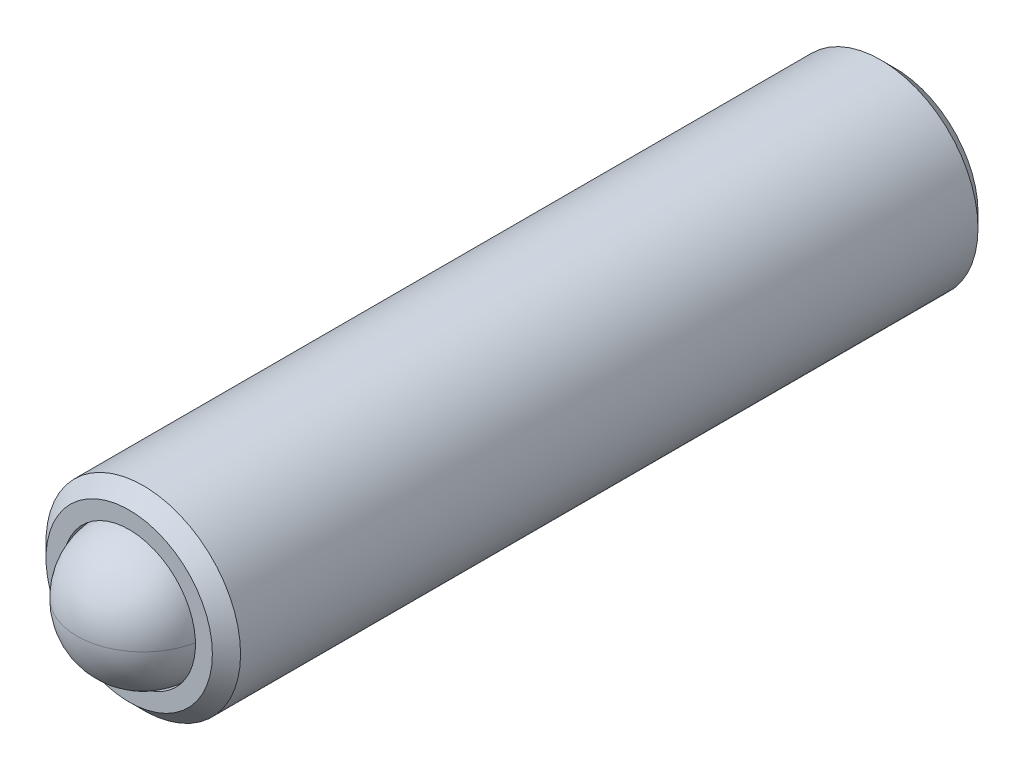
ISO-10303-21;
HEADER;
FILE_DESCRIPTION(('STEP AP214'),'2;1');
FILE_NAME('part.step','',(''),(''),'','','');
FILE_SCHEMA(('AUTOMOTIVE_DESIGN { 1 0 10303 214 1 1 1 1 }'));
ENDSEC;
DATA;
#1=APPLICATION_CONTEXT('core data for automotive mechanical design processes');
#2=APPLICATION_PROTOCOL_DEFINITION('international standard','automotive_design',2000,#1);
#3=PRODUCT_CONTEXT('',#1,'mechanical');
#4=PRODUCT('Part','Part','',(#3));
#5=PRODUCT_RELATED_PRODUCT_CATEGORY('part','',(#4));
#6=PRODUCT_DEFINITION_FORMATION('','',#4);
#7=PRODUCT_DEFINITION_CONTEXT('part definition',#1,'design');
#8=PRODUCT_DEFINITION('design','',#6,#7);
#9=PRODUCT_DEFINITION_SHAPE('','',#8);
#10=(LENGTH_UNIT() NAMED_UNIT(*) SI_UNIT(.MILLI.,.METRE.));
#11=(NAMED_UNIT(*) PLANE_ANGLE_UNIT() SI_UNIT($,.RADIAN.));
#12=(NAMED_UNIT(*) SI_UNIT($,.STERADIAN.) SOLID_ANGLE_UNIT());
#13=UNCERTAINTY_MEASURE_WITH_UNIT(LENGTH_MEASURE(1.E-05),#10,'distance_accuracy_value','');
#14=(GEOMETRIC_REPRESENTATION_CONTEXT(3) GLOBAL_UNCERTAINTY_ASSIGNED_CONTEXT((#13)) GLOBAL_UNIT_ASSIGNED_CONTEXT((#10,
#11,#12)) REPRESENTATION_CONTEXT('',''));
#15=CARTESIAN_POINT('',(0.,0.,0.));
#16=DIRECTION('',(0.,0.,1.));
#17=DIRECTION('',(1.,0.,0.));
#18=AXIS2_PLACEMENT_3D('',#15,#16,#17);
#19=CARTESIAN_POINT('',(0.,0.,6.645275));
#20=DIRECTION('',(0.,1.,0.));
#21=DIRECTION('',(1.,0.,0.));
#22=AXIS2_PLACEMENT_3D('',#19,#20,#21);
#23=SPHERICAL_SURFACE('',#22,1.190625);
#24=CARTESIAN_POINT('',(0.,0.,6.645275));
#25=DIRECTION('',(0.,0.,1.));
#26=DIRECTION('',(1.,0.,0.));
#27=AXIS2_PLACEMENT_3D('',#24,#25,#26);
#28=CIRCLE('',#27,1.190625);
#29=CARTESIAN_POINT('',(1.190625,0.,6.645275));
#30=VERTEX_POINT('',#29);
#31=CARTESIAN_POINT('',(-1.190625,0.,6.645275));
#32=VERTEX_POINT('',#31);
#33=EDGE_CURVE('P0_E33',#30,#32,#28,.T.);
#34=ORIENTED_EDGE('',*,*,#33,.T.);
#35=CARTESIAN_POINT('',(0.,0.,6.645275));
#36=DIRECTION('',(0.,1.,0.));
#37=DIRECTION('',(0.,0.,1.));
#38=AXIS2_PLACEMENT_3D('',#35,#36,#37);
#39=CIRCLE('',#38,1.190625);
#40=EDGE_CURVE('P0_E10',#32,#30,#39,.T.);
#41=ORIENTED_EDGE('',*,*,#40,.T.);
#42=EDGE_LOOP('',(#34,#41));
#43=FACE_BOUND('',#42,.T.);
#44=ADVANCED_FACE('P0_F16',(#43),#23,.T.);
#45=ORIENTED_EDGE('',*,*,#33,.F.);
#46=CARTESIAN_POINT('',(0.,0.,6.645275));
#47=DIRECTION('',(0.,1.,0.));
#48=DIRECTION('',(0.,0.,1.));
#49=AXIS2_PLACEMENT_3D('',#46,#47,#48);
#50=CIRCLE('',#49,1.190625);
#51=EDGE_CURVE('P0_E23',#30,#32,#50,.T.);
#52=ORIENTED_EDGE('',*,*,#51,.T.);
#53=EDGE_LOOP('',(#45,#52));
#54=FACE_BOUND('',#53,.T.);
#55=ADVANCED_FACE('P0_F40',(#54),#23,.T.);
#56=ORIENTED_EDGE('',*,*,#40,.F.);
#57=EDGE_CURVE('P0_E36',#32,#30,#28,.T.);
#58=ORIENTED_EDGE('',*,*,#57,.T.);
#59=EDGE_LOOP('',(#56,#58));
#60=FACE_BOUND('',#59,.T.);
#61=ADVANCED_FACE('P0_F38',(#60),#23,.T.);
#62=ORIENTED_EDGE('',*,*,#51,.F.);
#63=ORIENTED_EDGE('',*,*,#57,.F.);
#64=EDGE_LOOP('',(#62,#63));
#65=FACE_BOUND('',#64,.T.);
#66=ADVANCED_FACE('P0_F18',(#65),#23,.T.);
#67=CLOSED_SHELL('',(#44,#55,#61,#66));
#68=MANIFOLD_SOLID_BREP('P0_B1',#67);
#69=CARTESIAN_POINT('',(0.,0.,6.6421));
#70=DIRECTION('',(0.,0.,-1.));
#71=DIRECTION('',(-1.,0.,0.));
#72=AXIS2_PLACEMENT_3D('',#69,#70,#71);
#73=CONICAL_SURFACE('',#72,1.7526,0.785398163397448);
#74=CARTESIAN_POINT('',(0.,0.,6.8961));
#75=DIRECTION('',(0.,0.,1.));
#76=DIRECTION('',(1.,0.,0.));
#77=AXIS2_PLACEMENT_3D('',#74,#75,#76);
#78=CIRCLE('',#77,1.4986);
#79=CARTESIAN_POINT('',(1.4986,0.,6.8961));
#80=VERTEX_POINT('',#79);
#81=EDGE_CURVE('P1_E187',#80,#80,#78,.T.);
#82=ORIENTED_EDGE('',*,*,#81,.F.);
#83=EDGE_LOOP('',(#82));
#84=FACE_BOUND('',#83,.T.);
#85=CARTESIAN_POINT('',(0.,0.,6.6421));
#86=DIRECTION('',(0.,0.,1.));
#87=DIRECTION('',(1.,0.,0.));
#88=AXIS2_PLACEMENT_3D('',#85,#86,#87);
#89=CIRCLE('',#88,1.7526);
#90=CARTESIAN_POINT('',(1.7526,0.,6.6421));
#91=VERTEX_POINT('',#90);
#92=EDGE_CURVE('P1_E29',#91,#91,#89,.T.);
#93=ORIENTED_EDGE('',*,*,#92,.T.);
#94=EDGE_LOOP('',(#93));
#95=FACE_BOUND('',#94,.T.);
#96=ADVANCED_FACE('P1_F17',(#84,#95),#73,.T.);
#97=CARTESIAN_POINT('',(0.,0.,6.8961));
#98=DIRECTION('',(0.,0.,1.));
#99=DIRECTION('',(1.,0.,0.));
#100=AXIS2_PLACEMENT_3D('',#97,#98,#99);
#101=CYLINDRICAL_SURFACE('',#100,1.7526);
#102=ORIENTED_EDGE('',*,*,#92,.F.);
#103=EDGE_LOOP('',(#102));
#104=FACE_BOUND('',#103,.T.);
#105=CARTESIAN_POINT('',(0.,0.,-6.6421));
#106=DIRECTION('',(0.,0.,1.));
#107=DIRECTION('',(1.,0.,0.));
#108=AXIS2_PLACEMENT_3D('',#105,#106,#107);
#109=CIRCLE('',#108,1.7526);
#110=CARTESIAN_POINT('',(1.7526,0.,-6.6421));
#111=VERTEX_POINT('',#110);
#112=EDGE_CURVE('P1_E190',#111,#111,#109,.T.);
#113=ORIENTED_EDGE('',*,*,#112,.T.);
#114=EDGE_LOOP('',(#113));
#115=FACE_BOUND('',#114,.T.);
#116=ADVANCED_FACE('P1_F177',(#104,#115),#101,.T.);
#117=CARTESIAN_POINT('',(0.,0.,-6.8961));
#118=DIRECTION('',(0.,0.,1.));
#119=DIRECTION('',(1.,0.,0.));
#120=AXIS2_PLACEMENT_3D('',#117,#118,#119);
#121=CONICAL_SURFACE('',#120,1.4986,0.78539816339745);
#122=ORIENTED_EDGE('',*,*,#112,.F.);
#123=EDGE_LOOP('',(#122));
#124=FACE_BOUND('',#123,.T.);
#125=CARTESIAN_POINT('',(0.,0.,-6.8961));
#126=DIRECTION('',(0.,0.,1.));
#127=DIRECTION('',(1.,0.,0.));
#128=AXIS2_PLACEMENT_3D('',#125,#126,#127);
#129=CIRCLE('',#128,1.4986);
#130=CARTESIAN_POINT('',(1.4986,0.,-6.8961));
#131=VERTEX_POINT('',#130);
#132=EDGE_CURVE('P1_E192',#131,#131,#129,.T.);
#133=ORIENTED_EDGE('',*,*,#132,.T.);
#134=EDGE_LOOP('',(#133));
#135=FACE_BOUND('',#134,.T.);
#136=ADVANCED_FACE('P1_F182',(#124,#135),#121,.T.);
#137=CARTESIAN_POINT('',(0.,1.4986,-6.8961));
#138=DIRECTION('',(0.,0.,1.));
#139=DIRECTION('',(1.,0.,0.));
#140=AXIS2_PLACEMENT_3D('',#137,#138,#139);
#141=PLANE('',#140);
#142=CARTESIAN_POINT('',(0.,0.,-6.8961));
#143=DIRECTION('',(0.,0.,-1.));
#144=DIRECTION('',(0.,1.,0.));
#145=AXIS2_PLACEMENT_3D('',#142,#143,#144);
#146=CIRCLE('',#145,1.14567944042316);
#147=CARTESIAN_POINT('',(1.14567944042316,0.,-6.8961));
#148=VERTEX_POINT('',#147);
#149=CARTESIAN_POINT('',(0.57283972021158,-0.992187500000002,-6.8961));
#150=VERTEX_POINT('',#149);
#151=EDGE_CURVE('P1_E42',#148,#150,#146,.T.);
#152=ORIENTED_EDGE('',*,*,#151,.F.);
#153=CARTESIAN_POINT('',(0.572839720211582,0.9921875,-6.8961));
#154=VERTEX_POINT('',#153);
#155=EDGE_CURVE('P1_E115',#154,#148,#146,.T.);
#156=ORIENTED_EDGE('',*,*,#155,.F.);
#157=CARTESIAN_POINT('',(-0.572839720211581,0.9921875,-6.8961));
#158=VERTEX_POINT('',#157);
#159=EDGE_CURVE('P1_E114',#158,#154,#146,.T.);
#160=ORIENTED_EDGE('',*,*,#159,.F.);
#161=CARTESIAN_POINT('',(-1.14567944042316,0.,-6.8961));
#162=VERTEX_POINT('',#161);
#163=EDGE_CURVE('P1_E85',#162,#158,#146,.T.);
#164=ORIENTED_EDGE('',*,*,#163,.F.);
#165=CARTESIAN_POINT('',(-0.572839720211584,-0.9921875,-6.8961));
#166=VERTEX_POINT('',#165);
#167=EDGE_CURVE('P1_E77',#166,#162,#146,.T.);
#168=ORIENTED_EDGE('',*,*,#167,.F.);
#169=EDGE_CURVE('P1_E35',#150,#166,#146,.T.);
#170=ORIENTED_EDGE('',*,*,#169,.F.);
#171=EDGE_LOOP('',(#152,#156,#160,#164,#168,#170));
#172=FACE_BOUND('',#171,.T.);
#173=ORIENTED_EDGE('',*,*,#132,.F.);
#174=EDGE_LOOP('',(#173));
#175=FACE_BOUND('',#174,.T.);
#176=ADVANCED_FACE('P1_F111',(#172,#175),#141,.F.);
#177=CARTESIAN_POINT('',(0.,1.4986,6.8961));
#178=DIRECTION('',(0.,0.,-1.));
#179=DIRECTION('',(-1.,0.,0.));
#180=AXIS2_PLACEMENT_3D('',#177,#178,#179);
#181=PLANE('',#180);
#182=CARTESIAN_POINT('',(0.,0.,6.8961));
#183=DIRECTION('',(0.,0.,-1.));
#184=DIRECTION('',(-1.,0.,0.));
#185=AXIS2_PLACEMENT_3D('',#182,#183,#184);
#186=CIRCLE('',#185,1.1938);
#187=CARTESIAN_POINT('',(-1.1938,0.,6.8961));
#188=VERTEX_POINT('',#187);
#189=EDGE_CURVE('P1_E198',#188,#188,#186,.T.);
#190=ORIENTED_EDGE('',*,*,#189,.T.);
#191=EDGE_LOOP('',(#190));
#192=FACE_BOUND('',#191,.T.);
#193=ORIENTED_EDGE('',*,*,#81,.T.);
#194=EDGE_LOOP('',(#193));
#195=FACE_BOUND('',#194,.T.);
#196=ADVANCED_FACE('P1_F252',(#192,#195),#181,.F.);
#197=CARTESIAN_POINT('',(0.,0.,4.96147697729954));
#198=DIRECTION('',(0.,0.,-1.));
#199=DIRECTION('',(-1.,0.,0.));
#200=AXIS2_PLACEMENT_3D('',#197,#198,#199);
#201=CYLINDRICAL_SURFACE('',#200,1.1938);
#202=ORIENTED_EDGE('',*,*,#189,.F.);
#203=EDGE_LOOP('',(#202));
#204=FACE_BOUND('',#203,.T.);
#205=CARTESIAN_POINT('',(0.,0.,6.15527697729953));
#206=DIRECTION('',(0.,0.,-1.));
#207=DIRECTION('',(-1.,0.,0.));
#208=AXIS2_PLACEMENT_3D('',#205,#206,#207);
#209=CIRCLE('',#208,1.1938);
#210=CARTESIAN_POINT('',(-1.1938,0.,6.15527697729953));
#211=VERTEX_POINT('',#210);
#212=EDGE_CURVE('P1_E201',#211,#211,#209,.T.);
#213=ORIENTED_EDGE('',*,*,#212,.T.);
#214=EDGE_LOOP('',(#213));
#215=FACE_BOUND('',#214,.T.);
#216=ADVANCED_FACE('P1_F246',(#204,#215),#201,.F.);
#217=CARTESIAN_POINT('',(0.,0.,4.96147697729954));
#218=DIRECTION('',(0.,0.,1.));
#219=DIRECTION('',(1.,0.,0.));
#220=AXIS2_PLACEMENT_3D('',#217,#218,#219);
#221=CONICAL_SURFACE('',#220,0.,0.78539816339745);
#222=ORIENTED_EDGE('',*,*,#212,.F.);
#223=EDGE_LOOP('',(#222));
#224=FACE_BOUND('',#223,.T.);
#225=CARTESIAN_POINT('',(0.,0.,4.96147697729954));
#226=VERTEX_POINT('',#225);
#227=VERTEX_LOOP('',#226);
#228=FACE_BOUND('',#227,.T.);
#229=ADVANCED_FACE('P1_F242',(#224,#228),#221,.F.);
#230=CARTESIAN_POINT('',(0.,0.,-6.8961));
#231=DIRECTION('',(0.,0.,-1.));
#232=DIRECTION('',(0.,1.,0.));
#233=AXIS2_PLACEMENT_3D('',#230,#231,#232);
#234=CONICAL_SURFACE('',#233,1.14567944042316,0.785398163397443);
#235=ORIENTED_EDGE('',*,*,#163,.T.);
#236=CARTESIAN_POINT('',(-1.145794910477,-0.000199999999999318,-6.89621548750897));
#237=CARTESIAN_POINT('',(-1.12609913995856,0.0339140752321562,-6.87653281140465));
#238=CARTESIAN_POINT('',(-1.10607402631377,0.0685985894922795,-6.85800568451841));
#239=CARTESIAN_POINT('',(-1.06524035596264,0.139324581199958,-6.82408232965041));
#240=CARTESIAN_POINT('',(-1.04442791197037,0.175372791624241,-6.80870498723095));
#241=CARTESIAN_POINT('',(-1.00246048249573,0.248062511737393,-6.78236314273428));
#242=CARTESIAN_POINT('',(-0.981316196707013,0.284685489013198,-6.77133239651314));
#243=CARTESIAN_POINT('',(-0.93856224462359,0.358737506246053,-6.75433620567294));
#244=CARTESIAN_POINT('',(-0.916953885244214,0.396164282559339,-6.74835806757892));
#245=CARTESIAN_POINT('',(-0.879714587318156,0.460664638605466,-6.74296634491429));
#246=CARTESIAN_POINT('',(-0.864132099442445,0.487654299314524,-6.74216899638834));
#247=CARTESIAN_POINT('',(-0.832997298779855,0.541581355945658,-6.74350819336142));
#248=CARTESIAN_POINT('',(-0.817444993408176,0.568518739024233,-6.74564538613705));
#249=CARTESIAN_POINT('',(-0.771010163908489,0.648946222958489,-6.75631757130602));
#250=CARTESIAN_POINT('',(-0.740358726795451,0.702036069363274,-6.76911438072271));
#251=CARTESIAN_POINT('',(-0.686562055130084,0.795214637965789,-6.79999746765012));
#252=CARTESIAN_POINT('',(-0.663164549602747,0.83574030630951,-6.8164650089077));
#253=CARTESIAN_POINT('',(-0.617285982385524,0.915204315708204,-6.85356038355681));
#254=CARTESIAN_POINT('',(-0.594802217831309,0.954147338261522,-6.87417468064554));
#255=CARTESIAN_POINT('',(-0.572724250157744,0.9923875,-6.89621548750897));
#256=B_SPLINE_CURVE_WITH_KNOTS('',3,(#236,#237,#238,#239,#240,#241,#242,#243,#244,#245,#246,
#247,#248,#249,#250,#251,#252,#253,#254,#255),.UNSPECIFIED.,.F.,.F.,(4,2,2,2,2,2,2,2,2,4),(0.,
0.132197185210189,0.26516518685326,0.396020097605665,0.526545281028569,0.619935205043258,
0.713345731536156,0.900220051846357,1.04884529769095,1.1969930355767),.UNSPECIFIED.);
#257=EDGE_CURVE('P1_E11',#162,#158,#256,.T.);
#258=ORIENTED_EDGE('',*,*,#257,.F.);
#259=EDGE_LOOP('',(#235,#258));
#260=FACE_BOUND('',#259,.T.);
#261=ADVANCED_FACE('P1_F89',(#260),#234,.F.);
#262=ORIENTED_EDGE('',*,*,#159,.T.);
#263=CARTESIAN_POINT('',(-1.1424762107891,0.9921875,-7.26359203940828));
#264=CARTESIAN_POINT('',(-1.11465764801141,0.9921875,-7.2425916392497));
#265=CARTESIAN_POINT('',(-1.0866840809405,0.9921875,-7.22179714770579));
#266=CARTESIAN_POINT('',(-1.03036405365904,0.9921875,-7.18070503768691));
#267=CARTESIAN_POINT('',(-1.00201750223732,0.9921875,-7.16040754435707));
#268=CARTESIAN_POINT('',(-0.915909012346492,0.9921875,-7.10009850749393));
#269=CARTESIAN_POINT('',(-0.857501195839063,0.9921875,-7.06099385217264));
#270=CARTESIAN_POINT('',(-0.735022281240402,0.9921875,-6.98422675276114));
#271=CARTESIAN_POINT('',(-0.670818221894541,0.9921875,-6.94677403099626));
#272=CARTESIAN_POINT('',(-0.539203244212802,0.9921875,-6.87826502046105));
#273=CARTESIAN_POINT('',(-0.47180411896506,0.9921875,-6.84718716825431));
#274=CARTESIAN_POINT('',(-0.370637445252797,0.9921875,-6.80916629623627));
#275=CARTESIAN_POINT('',(-0.338367677251603,0.9921875,-6.79825403233245));
#276=CARTESIAN_POINT('',(-0.273049086247198,0.9921875,-6.77902023009933));
#277=CARTESIAN_POINT('',(-0.240000209742888,0.9921875,-6.77069887024719));
#278=CARTESIAN_POINT('',(-0.173878395816096,0.9921875,-6.75721877368215));
#279=CARTESIAN_POINT('',(-0.140816774716473,0.9921875,-6.75200539396509));
#280=CARTESIAN_POINT('',(-0.0743291671992177,0.9921875,-6.74483971245706));
#281=CARTESIAN_POINT('',(-0.0409031259919612,0.9921875,-6.74288790803542));
#282=CARTESIAN_POINT('',(0.0247631141129209,0.9921875,-6.74239348590571));
#283=CARTESIAN_POINT('',(0.0570024445003622,0.9921875,-6.74373003142075));
#284=CARTESIAN_POINT('',(0.121194220501065,0.9921875,-6.74947104321383));
#285=CARTESIAN_POINT('',(0.153146730366257,0.9921875,-6.75387480409386));
#286=CARTESIAN_POINT('',(0.21709052465773,0.9921875,-6.76558451115969));
#287=CARTESIAN_POINT('',(0.249072542149658,0.9921875,-6.77294030243664));
#288=CARTESIAN_POINT('',(0.312337779758389,0.9921875,-6.7901630913854));
#289=CARTESIAN_POINT('',(0.343621058108098,0.9921875,-6.80002987893501));
#290=CARTESIAN_POINT('',(0.442112983138552,0.9921875,-6.83480611159688));
#291=CARTESIAN_POINT('',(0.507919771198867,0.9921875,-6.86367616415081));
#292=CARTESIAN_POINT('',(0.636441891183628,0.9921875,-6.92786520992332));
#293=CARTESIAN_POINT('',(0.699145053961276,0.9921875,-6.96320737220964));
#294=CARTESIAN_POINT('',(0.818979830095471,0.9921875,-7.03612137086765));
#295=CARTESIAN_POINT('',(0.876233471712443,0.9921875,-7.07349513504845));
#296=CARTESIAN_POINT('',(0.960585190784971,0.9921875,-7.13127111190453));
#297=CARTESIAN_POINT('',(0.98833837842416,0.9921875,-7.15073348767094));
#298=CARTESIAN_POINT('',(1.04346551341384,0.9921875,-7.19017298177171));
#299=CARTESIAN_POINT('',(1.07083956239903,0.9921875,-7.21014995788476));
#300=CARTESIAN_POINT('',(1.09805574523308,0.9921875,-7.2303403056427));
#301=B_SPLINE_CURVE_WITH_KNOTS('',3,(#263,#264,#265,#266,#267,#268,#269,#270,#271,#272,#273,
#274,#275,#276,#277,#278,#279,#280,#281,#282,#283,#284,#285,#286,#287,#288,#289,#290,#291,#292,
#293,#294,#295,#296,#297,#298,#299,#300),.UNSPECIFIED.,.F.,.F.,(4,2,2,2,2,2,2,2,2,2,2,2,2,2,2,2,
2,2,4),(0.,0.104563127371702,0.209152318679106,0.41992709897511,0.642732653870151,
0.864771652131272,0.966879847039372,1.068995074223,1.16925752982866,1.26953527342201,
1.36618351686956,1.46280954049583,1.56114078094883,1.65946379566812,1.87441437168725,
2.09015003608819,2.29516517576013,2.39685303378665,2.49851308339964),.UNSPECIFIED.);
#302=EDGE_CURVE('P1_E118',#158,#154,#301,.T.);
#303=ORIENTED_EDGE('',*,*,#302,.F.);
#304=EDGE_LOOP('',(#262,#303));
#305=FACE_BOUND('',#304,.T.);
#306=ADVANCED_FACE('P1_F235',(#305),#234,.F.);
#307=ORIENTED_EDGE('',*,*,#155,.T.);
#308=CARTESIAN_POINT('',(0.572724250157745,0.9923875,-6.89621548750897));
#309=CARTESIAN_POINT('',(0.592420020676185,0.958273424767844,-6.87653281140465));
#310=CARTESIAN_POINT('',(0.612445134320978,0.923588910507721,-6.85800568451841));
#311=CARTESIAN_POINT('',(0.65327880467211,0.852862918800042,-6.82408232965041));
#312=CARTESIAN_POINT('',(0.674091248664374,0.816814708375759,-6.80870498723095));
#313=CARTESIAN_POINT('',(0.716058678139021,0.744124988262606,-6.78236314273428));
#314=CARTESIAN_POINT('',(0.737202963927733,0.707502010986801,-6.77133239651314));
#315=CARTESIAN_POINT('',(0.779956916011156,0.633449993753946,-6.75433620567294));
#316=CARTESIAN_POINT('',(0.801565275390532,0.59602321744066,-6.74835806757892));
#317=CARTESIAN_POINT('',(0.83880457331659,0.531522861394532,-6.74296634491429));
#318=CARTESIAN_POINT('',(0.854387061192302,0.504533200685474,-6.74216899638834));
#319=CARTESIAN_POINT('',(0.885521861854891,0.450606144054341,-6.74350819336142));
#320=CARTESIAN_POINT('',(0.90107416722657,0.423668760975766,-6.74564538613705));
#321=CARTESIAN_POINT('',(0.947508996726257,0.343241277041509,-6.75631757130602));
#322=CARTESIAN_POINT('',(0.978160433839296,0.290151430636725,-6.76911438072271));
#323=CARTESIAN_POINT('',(1.03195710550466,0.196972862034209,-6.79999746765012));
#324=CARTESIAN_POINT('',(1.055354611032,0.156447193690488,-6.8164650089077));
#325=CARTESIAN_POINT('',(1.10123317824922,0.0769831842917947,-6.85356038355681));
#326=CARTESIAN_POINT('',(1.12371694280344,0.0380401617384771,-6.87417468064554));
#327=CARTESIAN_POINT('',(1.145794910477,-0.000200000000000664,-6.89621548750897));
#328=B_SPLINE_CURVE_WITH_KNOTS('',3,(#308,#309,#310,#311,#312,#313,#314,#315,#316,#317,#318,
#319,#320,#321,#322,#323,#324,#325,#326,#327),.UNSPECIFIED.,.F.,.F.,(4,2,2,2,2,2,2,2,2,4),(0.,
0.132197185210189,0.265165186853261,0.396020097605667,0.526545281028571,0.61993520504326,
0.713345731536158,0.900220051846359,1.04884529769095,1.1969930355767),.UNSPECIFIED.);
#329=EDGE_CURVE('P1_E125',#154,#148,#328,.T.);
#330=ORIENTED_EDGE('',*,*,#329,.F.);
#331=EDGE_LOOP('',(#307,#330));
#332=FACE_BOUND('',#331,.T.);
#333=ADVANCED_FACE('P1_F232',(#332),#234,.F.);
#334=ORIENTED_EDGE('',*,*,#151,.T.);
#335=CARTESIAN_POINT('',(1.145794910477,0.000199999999999421,-6.89621548750897));
#336=CARTESIAN_POINT('',(1.12609913995856,-0.0339140752321562,-6.87653281140465));
#337=CARTESIAN_POINT('',(1.10607402631377,-0.0685985894922796,-6.85800568451841));
#338=CARTESIAN_POINT('',(1.06524035596264,-0.139324581199959,-6.82408232965041));
#339=CARTESIAN_POINT('',(1.04442791197037,-0.175372791624241,-6.80870498723095));
#340=CARTESIAN_POINT('',(1.00246048249572,-0.248062511737394,-6.78236314273428));
#341=CARTESIAN_POINT('',(0.981316196707013,-0.284685489013199,-6.77133239651314));
#342=CARTESIAN_POINT('',(0.938562244623589,-0.358737506246054,-6.75433620567294));
#343=CARTESIAN_POINT('',(0.916953885244214,-0.39616428255934,-6.74835806757892));
#344=CARTESIAN_POINT('',(0.879714587318155,-0.460664638605467,-6.74296634491429));
#345=CARTESIAN_POINT('',(0.864132099442444,-0.487654299314525,-6.74216899638834));
#346=CARTESIAN_POINT('',(0.832997298779855,-0.541581355945659,-6.74350819336142));
#347=CARTESIAN_POINT('',(0.817444993408175,-0.568518739024234,-6.74564538613705));
#348=CARTESIAN_POINT('',(0.771010163908488,-0.64894622295849,-6.75631757130602));
#349=CARTESIAN_POINT('',(0.74035872679545,-0.702036069363275,-6.76911438072271));
#350=CARTESIAN_POINT('',(0.686562055130084,-0.79521463796579,-6.79999746765012));
#351=CARTESIAN_POINT('',(0.663164549602747,-0.835740306309511,-6.8164650089077));
#352=CARTESIAN_POINT('',(0.617285982385524,-0.915204315708205,-6.85356038355681));
#353=CARTESIAN_POINT('',(0.594802217831309,-0.954147338261522,-6.87417468064554));
#354=CARTESIAN_POINT('',(0.572724250157744,-0.9923875,-6.89621548750897));
#355=B_SPLINE_CURVE_WITH_KNOTS('',3,(#335,#336,#337,#338,#339,#340,#341,#342,#343,#344,#345,
#346,#347,#348,#349,#350,#351,#352,#353,#354),.UNSPECIFIED.,.F.,.F.,(4,2,2,2,2,2,2,2,2,4),(0.,
0.13219718521019,0.265165186853262,0.396020097605668,0.526545281028571,0.61993520504326,
0.713345731536158,0.900220051846359,1.04884529769095,1.1969930355767),.UNSPECIFIED.);
#356=EDGE_CURVE('P1_E144',#148,#150,#355,.T.);
#357=ORIENTED_EDGE('',*,*,#356,.F.);
#358=EDGE_LOOP('',(#334,#357));
#359=FACE_BOUND('',#358,.T.);
#360=ADVANCED_FACE('P1_F241',(#359),#234,.F.);
#361=ORIENTED_EDGE('',*,*,#169,.T.);
#362=CARTESIAN_POINT('',(-1.14247621078911,-0.9921875,-7.26359203940828));
#363=CARTESIAN_POINT('',(-1.11465764801141,-0.9921875,-7.2425916392497));
#364=CARTESIAN_POINT('',(-1.08668408094051,-0.9921875,-7.22179714770579));
#365=CARTESIAN_POINT('',(-1.03036405365904,-0.9921875,-7.18070503768691));
#366=CARTESIAN_POINT('',(-1.00201750223733,-0.9921875,-7.16040754435707));
#367=CARTESIAN_POINT('',(-0.915909012346493,-0.9921875,-7.10009850749393));
#368=CARTESIAN_POINT('',(-0.857501195839064,-0.9921875,-7.06099385217264));
#369=CARTESIAN_POINT('',(-0.735022281240402,-0.9921875,-6.98422675276114));
#370=CARTESIAN_POINT('',(-0.670818221894541,-0.9921875,-6.94677403099626));
#371=CARTESIAN_POINT('',(-0.539203244212802,-0.9921875,-6.87826502046105));
#372=CARTESIAN_POINT('',(-0.471804118965061,-0.9921875,-6.84718716825431));
#373=CARTESIAN_POINT('',(-0.370637445252799,-0.9921875,-6.80916629623626));
#374=CARTESIAN_POINT('',(-0.338367677251605,-0.9921875,-6.79825403233245));
#375=CARTESIAN_POINT('',(-0.273049086247199,-0.9921875,-6.77902023009933));
#376=CARTESIAN_POINT('',(-0.240000209742889,-0.9921875,-6.77069887024719));
#377=CARTESIAN_POINT('',(-0.173878395816097,-0.9921875,-6.75721877368215));
#378=CARTESIAN_POINT('',(-0.140816774716474,-0.9921875,-6.75200539396509));
#379=CARTESIAN_POINT('',(-0.0743291671992187,-0.9921875,-6.74483971245705));
#380=CARTESIAN_POINT('',(-0.0409031259919621,-0.9921875,-6.74288790803542));
#381=CARTESIAN_POINT('',(0.0247631141129201,-0.9921875,-6.74239348590571));
#382=CARTESIAN_POINT('',(0.0570024445003613,-0.9921875,-6.74373003142075));
#383=CARTESIAN_POINT('',(0.121194220501064,-0.9921875,-6.74947104321383));
#384=CARTESIAN_POINT('',(0.153146730366256,-0.9921875,-6.75387480409386));
#385=CARTESIAN_POINT('',(0.217090524657729,-0.9921875,-6.76558451115969));
#386=CARTESIAN_POINT('',(0.249072542149657,-0.9921875,-6.77294030243664));
#387=CARTESIAN_POINT('',(0.312337779758388,-0.9921875,-6.7901630913854));
#388=CARTESIAN_POINT('',(0.343621058108097,-0.9921875,-6.80002987893501));
#389=CARTESIAN_POINT('',(0.442112983138551,-0.9921875,-6.83480611159687));
#390=CARTESIAN_POINT('',(0.507919771198865,-0.9921875,-6.8636761641508));
#391=CARTESIAN_POINT('',(0.636441891183625,-0.9921875,-6.92786520992332));
#392=CARTESIAN_POINT('',(0.699145053961273,-0.9921875,-6.96320737220964));
#393=CARTESIAN_POINT('',(0.818979830095468,-0.9921875,-7.03612137086765));
#394=CARTESIAN_POINT('',(0.87623347171244,-0.9921875,-7.07349513504845));
#395=CARTESIAN_POINT('',(0.960585190784967,-0.9921875,-7.13127111190453));
#396=CARTESIAN_POINT('',(0.988338378424157,-0.9921875,-7.15073348767094));
#397=CARTESIAN_POINT('',(1.04346551341383,-0.9921875,-7.19017298177171));
#398=CARTESIAN_POINT('',(1.07083956239902,-0.9921875,-7.21014995788476));
#399=CARTESIAN_POINT('',(1.09805574523308,-0.9921875,-7.23034030564269));
#400=B_SPLINE_CURVE_WITH_KNOTS('',3,(#362,#363,#364,#365,#366,#367,#368,#369,#370,#371,#372,
#373,#374,#375,#376,#377,#378,#379,#380,#381,#382,#383,#384,#385,#386,#387,#388,#389,#390,#391,
#392,#393,#394,#395,#396,#397,#398,#399),.UNSPECIFIED.,.F.,.F.,(4,2,2,2,2,2,2,2,2,2,2,2,2,2,2,2,
2,2,4),(0.,0.104563127371702,0.209152318679107,0.419927098975112,0.642732653870152,
0.864771652131273,0.966879847039373,1.06899507422301,1.16925752982866,1.26953527342201,
1.36618351686956,1.46280954049583,1.56114078094884,1.65946379566812,1.87441437168725,
2.09015003608819,2.29516517576013,2.39685303378665,2.49851308339963),.UNSPECIFIED.);
#401=EDGE_CURVE('P1_E101',#150,#166,#400,.F.);
#402=ORIENTED_EDGE('',*,*,#401,.F.);
#403=EDGE_LOOP('',(#361,#402));
#404=FACE_BOUND('',#403,.T.);
#405=ADVANCED_FACE('P1_F137',(#404),#234,.F.);
#406=ORIENTED_EDGE('',*,*,#167,.T.);
#407=CARTESIAN_POINT('',(-0.572724250157745,-0.9923875,-6.89621548750897));
#408=CARTESIAN_POINT('',(-0.592420020676185,-0.958273424767844,-6.87653281140465));
#409=CARTESIAN_POINT('',(-0.612445134320978,-0.923588910507721,-6.85800568451841));
#410=CARTESIAN_POINT('',(-0.65327880467211,-0.852862918800042,-6.82408232965041));
#411=CARTESIAN_POINT('',(-0.674091248664374,-0.816814708375759,-6.80870498723095));
#412=CARTESIAN_POINT('',(-0.716058678139021,-0.744124988262607,-6.78236314273428));
#413=CARTESIAN_POINT('',(-0.737202963927732,-0.707502010986801,-6.77133239651314));
#414=CARTESIAN_POINT('',(-0.779956916011156,-0.633449993753947,-6.75433620567294));
#415=CARTESIAN_POINT('',(-0.801565275390531,-0.596023217440661,-6.74835806757892));
#416=CARTESIAN_POINT('',(-0.838804573316589,-0.531522861394534,-6.74296634491429));
#417=CARTESIAN_POINT('',(-0.854387061192301,-0.504533200685476,-6.74216899638834));
#418=CARTESIAN_POINT('',(-0.88552186185489,-0.450606144054342,-6.74350819336142));
#419=CARTESIAN_POINT('',(-0.901074167226569,-0.423668760975767,-6.74564538613705));
#420=CARTESIAN_POINT('',(-0.947508996726256,-0.343241277041511,-6.75631757130602));
#421=CARTESIAN_POINT('',(-0.978160433839295,-0.290151430636726,-6.76911438072271));
#422=CARTESIAN_POINT('',(-1.03195710550466,-0.19697286203421,-6.79999746765012));
#423=CARTESIAN_POINT('',(-1.055354611032,-0.15644719369049,-6.8164650089077));
#424=CARTESIAN_POINT('',(-1.10123317824922,-0.0769831842917955,-6.85356038355681));
#425=CARTESIAN_POINT('',(-1.12371694280344,-0.0380401617384776,-6.87417468064554));
#426=CARTESIAN_POINT('',(-1.145794910477,0.000200000000000454,-6.89621548750897));
#427=B_SPLINE_CURVE_WITH_KNOTS('',3,(#407,#408,#409,#410,#411,#412,#413,#414,#415,#416,#417,
#418,#419,#420,#421,#422,#423,#424,#425,#426),.UNSPECIFIED.,.F.,.F.,(4,2,2,2,2,2,2,2,2,4),(0.,
0.132197185210189,0.26516518685326,0.396020097605666,0.526545281028569,0.619935205043258,
0.713345731536156,0.900220051846357,1.04884529769095,1.1969930355767),.UNSPECIFIED.);
#428=EDGE_CURVE('P1_E81',#166,#162,#427,.T.);
#429=ORIENTED_EDGE('',*,*,#428,.F.);
#430=EDGE_LOOP('',(#406,#429));
#431=FACE_BOUND('',#430,.T.);
#432=ADVANCED_FACE('P1_F79',(#431),#234,.F.);
#433=CARTESIAN_POINT('',(0.,0.,-3.8481));
#434=DIRECTION('',(0.,0.,-1.));
#435=DIRECTION('',(-1.,0.,0.));
#436=AXIS2_PLACEMENT_3D('',#433,#434,#435);
#437=PLANE('',#436);
#438=DIRECTION('',(-0.499999999999999,0.866025403784439,0.));
#439=VECTOR('',#438,1.);
#440=CARTESIAN_POINT('',(-0.572839720211582,-0.9921875,-3.8481));
#441=LINE('',#440,#439);
#442=CARTESIAN_POINT('',(-0.572839720211582,-0.9921875,-3.8481));
#443=VERTEX_POINT('',#442);
#444=CARTESIAN_POINT('',(-1.14567944042316,0.,-3.8481));
#445=VERTEX_POINT('',#444);
#446=EDGE_CURVE('P1_E100',#443,#445,#441,.T.);
#447=ORIENTED_EDGE('',*,*,#446,.T.);
#448=DIRECTION('',(0.5,0.866025403784438,0.));
#449=VECTOR('',#448,1.);
#450=CARTESIAN_POINT('',(-1.14567944042316,0.,-3.8481));
#451=LINE('',#450,#449);
#452=CARTESIAN_POINT('',(-0.572839720211581,0.9921875,-3.8481));
#453=VERTEX_POINT('',#452);
#454=EDGE_CURVE('P1_E105',#445,#453,#451,.T.);
#455=ORIENTED_EDGE('',*,*,#454,.T.);
#456=DIRECTION('',(1.,0.,0.));
#457=VECTOR('',#456,1.);
#458=CARTESIAN_POINT('',(-0.572839720211581,0.9921875,-3.8481));
#459=LINE('',#458,#457);
#460=CARTESIAN_POINT('',(0.572839720211582,0.9921875,-3.8481));
#461=VERTEX_POINT('',#460);
#462=EDGE_CURVE('P1_E221',#453,#461,#459,.T.);
#463=ORIENTED_EDGE('',*,*,#462,.T.);
#464=DIRECTION('',(0.499999999999999,-0.866025403784439,0.));
#465=VECTOR('',#464,1.);
#466=CARTESIAN_POINT('',(0.572839720211582,0.9921875,-3.8481));
#467=LINE('',#466,#465);
#468=CARTESIAN_POINT('',(1.14567944042316,0.,-3.8481));
#469=VERTEX_POINT('',#468);
#470=EDGE_CURVE('P1_E218',#461,#469,#467,.T.);
#471=ORIENTED_EDGE('',*,*,#470,.T.);
#472=DIRECTION('',(-0.5,-0.866025403784438,0.));
#473=VECTOR('',#472,1.);
#474=CARTESIAN_POINT('',(1.14567944042316,0.,-3.8481));
#475=LINE('',#474,#473);
#476=CARTESIAN_POINT('',(0.572839720211582,-0.9921875,-3.8481));
#477=VERTEX_POINT('',#476);
#478=EDGE_CURVE('P1_E215',#469,#477,#475,.T.);
#479=ORIENTED_EDGE('',*,*,#478,.T.);
#480=DIRECTION('',(-1.,0.,0.));
#481=VECTOR('',#480,1.);
#482=CARTESIAN_POINT('',(0.572839720211582,-0.9921875,-3.8481));
#483=LINE('',#482,#481);
#484=EDGE_CURVE('P1_E108',#477,#443,#483,.T.);
#485=ORIENTED_EDGE('',*,*,#484,.T.);
#486=EDGE_LOOP('',(#447,#455,#463,#471,#479,#485));
#487=FACE_BOUND('',#486,.T.);
#488=ADVANCED_FACE('P1_F136',(#487),#437,.T.);
#489=CARTESIAN_POINT('',(-1.14567944042316,0.,-3.8481));
#490=DIRECTION('',(-0.866025403784438,0.5,0.));
#491=DIRECTION('',(-0.5,-0.866025403784439,0.));
#492=AXIS2_PLACEMENT_3D('',#489,#490,#491);
#493=PLANE('',#492);
#494=DIRECTION('',(0.,0.,-1.));
#495=VECTOR('',#494,1.);
#496=CARTESIAN_POINT('',(-1.14567944042316,0.,-3.8481));
#497=LINE('',#496,#495);
#498=EDGE_CURVE('P1_E97',#445,#162,#497,.T.);
#499=ORIENTED_EDGE('',*,*,#498,.T.);
#500=ORIENTED_EDGE('',*,*,#257,.T.);
#501=DIRECTION('',(0.,0.,-1.));
#502=VECTOR('',#501,1.);
#503=CARTESIAN_POINT('',(-0.572839720211581,0.9921875,-3.8481));
#504=LINE('',#503,#502);
#505=EDGE_CURVE('P1_E107',#453,#158,#504,.T.);
#506=ORIENTED_EDGE('',*,*,#505,.F.);
#507=ORIENTED_EDGE('',*,*,#454,.F.);
#508=EDGE_LOOP('',(#499,#500,#506,#507));
#509=FACE_BOUND('',#508,.T.);
#510=ADVANCED_FACE('P1_F103',(#509),#493,.F.);
#511=CARTESIAN_POINT('',(-0.572839720211581,0.9921875,-3.8481));
#512=DIRECTION('',(0.,1.,0.));
#513=DIRECTION('',(0.,0.,1.));
#514=AXIS2_PLACEMENT_3D('',#511,#512,#513);
#515=PLANE('',#514);
#516=ORIENTED_EDGE('',*,*,#505,.T.);
#517=ORIENTED_EDGE('',*,*,#302,.T.);
#518=DIRECTION('',(0.,0.,-1.));
#519=VECTOR('',#518,1.);
#520=CARTESIAN_POINT('',(0.572839720211582,0.9921875,-3.8481));
#521=LINE('',#520,#519);
#522=EDGE_CURVE('P1_E205',#461,#154,#521,.T.);
#523=ORIENTED_EDGE('',*,*,#522,.F.);
#524=ORIENTED_EDGE('',*,*,#462,.F.);
#525=EDGE_LOOP('',(#516,#517,#523,#524));
#526=FACE_BOUND('',#525,.T.);
#527=ADVANCED_FACE('P1_F131',(#526),#515,.F.);
#528=CARTESIAN_POINT('',(0.572839720211582,0.9921875,-3.8481));
#529=DIRECTION('',(0.866025403784439,0.499999999999999,0.));
#530=DIRECTION('',(-0.499999999999999,0.866025403784439,0.));
#531=AXIS2_PLACEMENT_3D('',#528,#529,#530);
#532=PLANE('',#531);
#533=ORIENTED_EDGE('',*,*,#522,.T.);
#534=ORIENTED_EDGE('',*,*,#329,.T.);
#535=DIRECTION('',(0.,0.,-1.));
#536=VECTOR('',#535,1.);
#537=CARTESIAN_POINT('',(1.14567944042316,0.,-3.8481));
#538=LINE('',#537,#536);
#539=EDGE_CURVE('P1_E207',#469,#148,#538,.T.);
#540=ORIENTED_EDGE('',*,*,#539,.F.);
#541=ORIENTED_EDGE('',*,*,#470,.F.);
#542=EDGE_LOOP('',(#533,#534,#540,#541));
#543=FACE_BOUND('',#542,.T.);
#544=ADVANCED_FACE('P1_F165',(#543),#532,.F.);
#545=CARTESIAN_POINT('',(1.14567944042316,0.,-3.8481));
#546=DIRECTION('',(0.866025403784438,-0.5,0.));
#547=DIRECTION('',(0.5,0.866025403784439,0.));
#548=AXIS2_PLACEMENT_3D('',#545,#546,#547);
#549=PLANE('',#548);
#550=ORIENTED_EDGE('',*,*,#539,.T.);
#551=ORIENTED_EDGE('',*,*,#356,.T.);
#552=DIRECTION('',(0.,0.,-1.));
#553=VECTOR('',#552,1.);
#554=CARTESIAN_POINT('',(0.572839720211582,-0.9921875,-3.8481));
#555=LINE('',#554,#553);
#556=EDGE_CURVE('P1_E209',#477,#150,#555,.T.);
#557=ORIENTED_EDGE('',*,*,#556,.F.);
#558=ORIENTED_EDGE('',*,*,#478,.F.);
#559=EDGE_LOOP('',(#550,#551,#557,#558));
#560=FACE_BOUND('',#559,.T.);
#561=ADVANCED_FACE('P1_F161',(#560),#549,.F.);
#562=CARTESIAN_POINT('',(0.572839720211582,-0.9921875,-3.8481));
#563=DIRECTION('',(0.,-1.,0.));
#564=DIRECTION('',(1.,0.,0.));
#565=AXIS2_PLACEMENT_3D('',#562,#563,#564);
#566=PLANE('',#565);
#567=ORIENTED_EDGE('',*,*,#556,.T.);
#568=ORIENTED_EDGE('',*,*,#401,.T.);
#569=DIRECTION('',(0.,0.,-1.));
#570=VECTOR('',#569,1.);
#571=CARTESIAN_POINT('',(-0.572839720211582,-0.9921875,-3.8481));
#572=LINE('',#571,#570);
#573=EDGE_CURVE('P1_E99',#443,#166,#572,.T.);
#574=ORIENTED_EDGE('',*,*,#573,.F.);
#575=ORIENTED_EDGE('',*,*,#484,.F.);
#576=EDGE_LOOP('',(#567,#568,#574,#575));
#577=FACE_BOUND('',#576,.T.);
#578=ADVANCED_FACE('P1_F158',(#577),#566,.F.);
#579=CARTESIAN_POINT('',(-0.572839720211582,-0.9921875,-3.8481));
#580=DIRECTION('',(-0.866025403784439,-0.499999999999999,0.));
#581=DIRECTION('',(0.499999999999999,-0.866025403784439,0.));
#582=AXIS2_PLACEMENT_3D('',#579,#580,#581);
#583=PLANE('',#582);
#584=ORIENTED_EDGE('',*,*,#573,.T.);
#585=ORIENTED_EDGE('',*,*,#428,.T.);
#586=ORIENTED_EDGE('',*,*,#498,.F.);
#587=ORIENTED_EDGE('',*,*,#446,.F.);
#588=EDGE_LOOP('',(#584,#585,#586,#587));
#589=FACE_BOUND('',#588,.T.);
#590=ADVANCED_FACE('P1_F95',(#589),#583,.F.);
#591=CLOSED_SHELL('',(#96,#116,#136,#176,#196,#216,#229,#261,#306,#333,#360,#405,#432,#488,#510,
#527,#544,#561,#578,#590));
#592=MANIFOLD_SOLID_BREP('P1_B1',#591);
#593=ADVANCED_BREP_SHAPE_REPRESENTATION('',(#18,#68,#592),#14);
#594=SHAPE_DEFINITION_REPRESENTATION(#9,#593);
ENDSEC;
END-ISO-10303-21;
